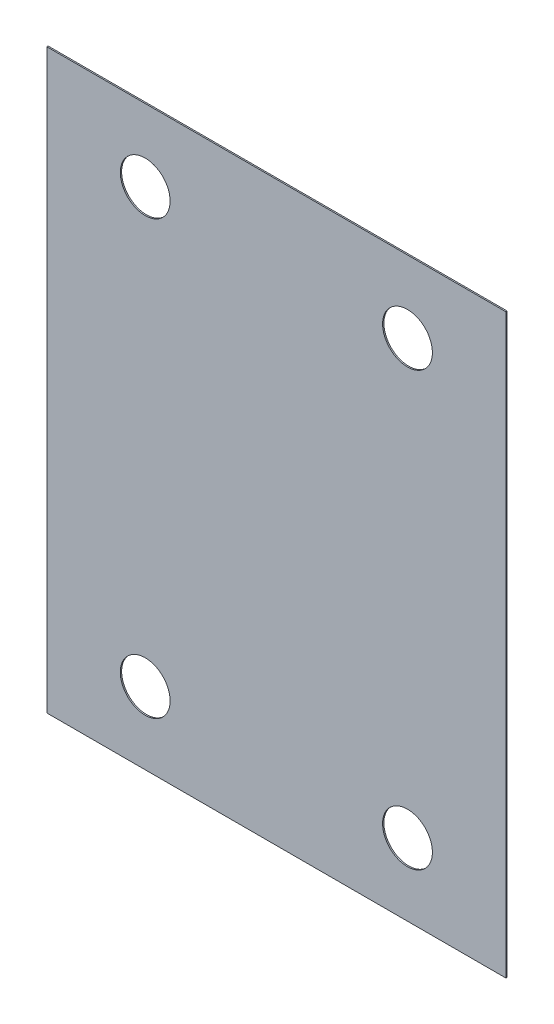
ISO-10303-21;
HEADER;
FILE_DESCRIPTION(('STEP AP214'),'2;1');
FILE_NAME('part.step','',(''),(''),'','','');
FILE_SCHEMA(('AUTOMOTIVE_DESIGN { 1 0 10303 214 1 1 1 1 }'));
ENDSEC;
DATA;
#1=APPLICATION_CONTEXT('core data for automotive mechanical design processes');
#2=APPLICATION_PROTOCOL_DEFINITION('international standard','automotive_design',2000,#1);
#3=PRODUCT_CONTEXT('',#1,'mechanical');
#4=PRODUCT('Part','Part','',(#3));
#5=PRODUCT_RELATED_PRODUCT_CATEGORY('part','',(#4));
#6=PRODUCT_DEFINITION_FORMATION('','',#4);
#7=PRODUCT_DEFINITION_CONTEXT('part definition',#1,'design');
#8=PRODUCT_DEFINITION('design','',#6,#7);
#9=PRODUCT_DEFINITION_SHAPE('','',#8);
#10=(LENGTH_UNIT() NAMED_UNIT(*) SI_UNIT(.MILLI.,.METRE.));
#11=(NAMED_UNIT(*) PLANE_ANGLE_UNIT() SI_UNIT($,.RADIAN.));
#12=(NAMED_UNIT(*) SI_UNIT($,.STERADIAN.) SOLID_ANGLE_UNIT());
#13=UNCERTAINTY_MEASURE_WITH_UNIT(LENGTH_MEASURE(1.E-05),#10,'distance_accuracy_value','');
#14=(GEOMETRIC_REPRESENTATION_CONTEXT(3) GLOBAL_UNCERTAINTY_ASSIGNED_CONTEXT((#13)) GLOBAL_UNIT_ASSIGNED_CONTEXT((#10,
#11,#12)) REPRESENTATION_CONTEXT('',''));
#15=CARTESIAN_POINT('',(0.,0.,0.));
#16=DIRECTION('',(0.,0.,1.));
#17=DIRECTION('',(1.,0.,0.));
#18=AXIS2_PLACEMENT_3D('',#15,#16,#17);
#19=CARTESIAN_POINT('',(0.,0.,1.));
#20=DIRECTION('',(0.,0.,1.));
#21=DIRECTION('',(1.,0.,0.));
#22=AXIS2_PLACEMENT_3D('',#19,#20,#21);
#23=PLANE('',#22);
#24=CARTESIAN_POINT('',(100.,-165.,1.));
#25=DIRECTION('',(0.,0.,1.));
#26=DIRECTION('',(1.,0.,0.));
#27=AXIS2_PLACEMENT_3D('',#24,#25,#26);
#28=CIRCLE('',#27,19.);
#29=CARTESIAN_POINT('',(119.,-165.,1.));
#30=VERTEX_POINT('',#29);
#31=EDGE_CURVE('E121',#30,#30,#28,.T.);
#32=ORIENTED_EDGE('',*,*,#31,.F.);
#33=EDGE_LOOP('',(#32));
#34=FACE_BOUND('',#33,.T.);
#35=CARTESIAN_POINT('',(-100.,165.,1.));
#36=DIRECTION('',(0.,0.,1.));
#37=DIRECTION('',(1.,0.,0.));
#38=AXIS2_PLACEMENT_3D('',#35,#36,#37);
#39=CIRCLE('',#38,19.0000000000034);
#40=CARTESIAN_POINT('',(-80.9999999999966,165.,1.));
#41=VERTEX_POINT('',#40);
#42=EDGE_CURVE('E100',#41,#41,#39,.T.);
#43=ORIENTED_EDGE('',*,*,#42,.F.);
#44=EDGE_LOOP('',(#43));
#45=FACE_BOUND('',#44,.T.);
#46=DIRECTION('',(1.,0.,0.));
#47=VECTOR('',#46,1.);
#48=CARTESIAN_POINT('',(-175.,-220.,1.));
#49=LINE('',#48,#47);
#50=CARTESIAN_POINT('',(-175.,-220.,1.));
#51=VERTEX_POINT('',#50);
#52=CARTESIAN_POINT('',(175.,-220.,1.));
#53=VERTEX_POINT('',#52);
#54=EDGE_CURVE('E85',#51,#53,#49,.T.);
#55=ORIENTED_EDGE('',*,*,#54,.T.);
#56=DIRECTION('',(0.,1.,0.));
#57=VECTOR('',#56,1.);
#58=CARTESIAN_POINT('',(175.,-220.,1.));
#59=LINE('',#58,#57);
#60=CARTESIAN_POINT('',(175.,220.,1.));
#61=VERTEX_POINT('',#60);
#62=EDGE_CURVE('E80',#53,#61,#59,.T.);
#63=ORIENTED_EDGE('',*,*,#62,.T.);
#64=DIRECTION('',(-1.,0.,0.));
#65=VECTOR('',#64,1.);
#66=CARTESIAN_POINT('',(175.,220.,1.));
#67=LINE('',#66,#65);
#68=CARTESIAN_POINT('',(-175.,220.,1.));
#69=VERTEX_POINT('',#68);
#70=EDGE_CURVE('E83',#61,#69,#67,.T.);
#71=ORIENTED_EDGE('',*,*,#70,.T.);
#72=DIRECTION('',(0.,-1.,0.));
#73=VECTOR('',#72,1.);
#74=CARTESIAN_POINT('',(-175.,220.,1.));
#75=LINE('',#74,#73);
#76=EDGE_CURVE('E50',#69,#51,#75,.T.);
#77=ORIENTED_EDGE('',*,*,#76,.T.);
#78=EDGE_LOOP('',(#55,#63,#71,#77));
#79=FACE_BOUND('',#78,.T.);
#80=CARTESIAN_POINT('',(100.,165.,1.));
#81=DIRECTION('',(0.,0.,1.));
#82=DIRECTION('',(1.,0.,0.));
#83=AXIS2_PLACEMENT_3D('',#80,#81,#82);
#84=CIRCLE('',#83,18.999999999996);
#85=CARTESIAN_POINT('',(118.999999999996,165.,1.));
#86=VERTEX_POINT('',#85);
#87=EDGE_CURVE('E115',#86,#86,#84,.T.);
#88=ORIENTED_EDGE('',*,*,#87,.F.);
#89=EDGE_LOOP('',(#88));
#90=FACE_BOUND('',#89,.T.);
#91=CARTESIAN_POINT('',(-100.,-165.,1.));
#92=DIRECTION('',(0.,0.,1.));
#93=DIRECTION('',(1.,0.,0.));
#94=AXIS2_PLACEMENT_3D('',#91,#92,#93);
#95=CIRCLE('',#94,19.);
#96=CARTESIAN_POINT('',(-81.,-165.,1.));
#97=VERTEX_POINT('',#96);
#98=EDGE_CURVE('E127',#97,#97,#95,.T.);
#99=ORIENTED_EDGE('',*,*,#98,.F.);
#100=EDGE_LOOP('',(#99));
#101=FACE_BOUND('',#100,.T.);
#102=ADVANCED_FACE('F33',(#34,#45,#79,#90,#101),#23,.T.);
#103=CARTESIAN_POINT('',(0.,0.,0.));
#104=DIRECTION('',(0.,0.,1.));
#105=DIRECTION('',(1.,0.,0.));
#106=AXIS2_PLACEMENT_3D('',#103,#104,#105);
#107=PLANE('',#106);
#108=DIRECTION('',(1.,0.,0.));
#109=VECTOR('',#108,1.);
#110=CARTESIAN_POINT('',(-175.,-220.,0.));
#111=LINE('',#110,#109);
#112=CARTESIAN_POINT('',(-175.,-220.,0.));
#113=VERTEX_POINT('',#112);
#114=CARTESIAN_POINT('',(175.,-220.,0.));
#115=VERTEX_POINT('',#114);
#116=EDGE_CURVE('E97',#113,#115,#111,.T.);
#117=ORIENTED_EDGE('',*,*,#116,.F.);
#118=DIRECTION('',(0.,-1.,0.));
#119=VECTOR('',#118,1.);
#120=CARTESIAN_POINT('',(-175.,220.,0.));
#121=LINE('',#120,#119);
#122=CARTESIAN_POINT('',(-175.,220.,0.));
#123=VERTEX_POINT('',#122);
#124=EDGE_CURVE('E73',#123,#113,#121,.T.);
#125=ORIENTED_EDGE('',*,*,#124,.F.);
#126=DIRECTION('',(-1.,0.,0.));
#127=VECTOR('',#126,1.);
#128=CARTESIAN_POINT('',(175.,220.,0.));
#129=LINE('',#128,#127);
#130=CARTESIAN_POINT('',(175.,220.,0.));
#131=VERTEX_POINT('',#130);
#132=EDGE_CURVE('E67',#131,#123,#129,.T.);
#133=ORIENTED_EDGE('',*,*,#132,.F.);
#134=DIRECTION('',(0.,1.,0.));
#135=VECTOR('',#134,1.);
#136=CARTESIAN_POINT('',(175.,-220.,0.));
#137=LINE('',#136,#135);
#138=EDGE_CURVE('E89',#115,#131,#137,.T.);
#139=ORIENTED_EDGE('',*,*,#138,.F.);
#140=EDGE_LOOP('',(#117,#125,#133,#139));
#141=FACE_BOUND('',#140,.T.);
#142=CARTESIAN_POINT('',(-100.,165.,0.));
#143=DIRECTION('',(0.,0.,1.));
#144=DIRECTION('',(1.,0.,0.));
#145=AXIS2_PLACEMENT_3D('',#142,#143,#144);
#146=CIRCLE('',#145,19.0000000000034);
#147=CARTESIAN_POINT('',(-80.9999999999966,165.,0.));
#148=VERTEX_POINT('',#147);
#149=EDGE_CURVE('E112',#148,#148,#146,.T.);
#150=ORIENTED_EDGE('',*,*,#149,.T.);
#151=EDGE_LOOP('',(#150));
#152=FACE_BOUND('',#151,.T.);
#153=CARTESIAN_POINT('',(100.,165.,0.));
#154=DIRECTION('',(0.,0.,1.));
#155=DIRECTION('',(1.,0.,0.));
#156=AXIS2_PLACEMENT_3D('',#153,#154,#155);
#157=CIRCLE('',#156,18.999999999996);
#158=CARTESIAN_POINT('',(118.999999999996,165.,0.));
#159=VERTEX_POINT('',#158);
#160=EDGE_CURVE('E118',#159,#159,#157,.T.);
#161=ORIENTED_EDGE('',*,*,#160,.T.);
#162=EDGE_LOOP('',(#161));
#163=FACE_BOUND('',#162,.T.);
#164=CARTESIAN_POINT('',(100.,-165.,0.));
#165=DIRECTION('',(0.,0.,1.));
#166=DIRECTION('',(1.,0.,0.));
#167=AXIS2_PLACEMENT_3D('',#164,#165,#166);
#168=CIRCLE('',#167,19.);
#169=CARTESIAN_POINT('',(119.,-165.,0.));
#170=VERTEX_POINT('',#169);
#171=EDGE_CURVE('E124',#170,#170,#168,.T.);
#172=ORIENTED_EDGE('',*,*,#171,.T.);
#173=EDGE_LOOP('',(#172));
#174=FACE_BOUND('',#173,.T.);
#175=CARTESIAN_POINT('',(-100.,-165.,0.));
#176=DIRECTION('',(0.,0.,1.));
#177=DIRECTION('',(1.,0.,0.));
#178=AXIS2_PLACEMENT_3D('',#175,#176,#177);
#179=CIRCLE('',#178,19.);
#180=CARTESIAN_POINT('',(-81.,-165.,0.));
#181=VERTEX_POINT('',#180);
#182=EDGE_CURVE('E130',#181,#181,#179,.T.);
#183=ORIENTED_EDGE('',*,*,#182,.T.);
#184=EDGE_LOOP('',(#183));
#185=FACE_BOUND('',#184,.T.);
#186=ADVANCED_FACE('F108',(#141,#152,#163,#174,#185),#107,.F.);
#187=CARTESIAN_POINT('',(-175.,-220.,1.));
#188=DIRECTION('',(0.,1.,0.));
#189=DIRECTION('',(0.,0.,1.));
#190=AXIS2_PLACEMENT_3D('',#187,#188,#189);
#191=PLANE('',#190);
#192=ORIENTED_EDGE('',*,*,#116,.T.);
#193=DIRECTION('',(0.,0.,-1.));
#194=VECTOR('',#193,1.);
#195=CARTESIAN_POINT('',(175.,-220.,1.));
#196=LINE('',#195,#194);
#197=EDGE_CURVE('E11',#53,#115,#196,.T.);
#198=ORIENTED_EDGE('',*,*,#197,.F.);
#199=ORIENTED_EDGE('',*,*,#54,.F.);
#200=DIRECTION('',(0.,0.,-1.));
#201=VECTOR('',#200,1.);
#202=CARTESIAN_POINT('',(-175.,-220.,1.));
#203=LINE('',#202,#201);
#204=EDGE_CURVE('E93',#51,#113,#203,.T.);
#205=ORIENTED_EDGE('',*,*,#204,.T.);
#206=EDGE_LOOP('',(#192,#198,#199,#205));
#207=FACE_BOUND('',#206,.T.);
#208=ADVANCED_FACE('F35',(#207),#191,.F.);
#209=CARTESIAN_POINT('',(175.,-220.,1.));
#210=DIRECTION('',(-1.,0.,0.));
#211=DIRECTION('',(0.,0.,1.));
#212=AXIS2_PLACEMENT_3D('',#209,#210,#211);
#213=PLANE('',#212);
#214=ORIENTED_EDGE('',*,*,#138,.T.);
#215=DIRECTION('',(0.,0.,-1.));
#216=VECTOR('',#215,1.);
#217=CARTESIAN_POINT('',(175.,220.,1.));
#218=LINE('',#217,#216);
#219=EDGE_CURVE('E42',#61,#131,#218,.T.);
#220=ORIENTED_EDGE('',*,*,#219,.F.);
#221=ORIENTED_EDGE('',*,*,#62,.F.);
#222=ORIENTED_EDGE('',*,*,#197,.T.);
#223=EDGE_LOOP('',(#214,#220,#221,#222));
#224=FACE_BOUND('',#223,.T.);
#225=ADVANCED_FACE('F88',(#224),#213,.F.);
#226=CARTESIAN_POINT('',(175.,220.,1.));
#227=DIRECTION('',(0.,-1.,0.));
#228=DIRECTION('',(0.,0.,-1.));
#229=AXIS2_PLACEMENT_3D('',#226,#227,#228);
#230=PLANE('',#229);
#231=ORIENTED_EDGE('',*,*,#132,.T.);
#232=DIRECTION('',(0.,0.,-1.));
#233=VECTOR('',#232,1.);
#234=CARTESIAN_POINT('',(-175.,220.,1.));
#235=LINE('',#234,#233);
#236=EDGE_CURVE('E90',#69,#123,#235,.T.);
#237=ORIENTED_EDGE('',*,*,#236,.F.);
#238=ORIENTED_EDGE('',*,*,#70,.F.);
#239=ORIENTED_EDGE('',*,*,#219,.T.);
#240=EDGE_LOOP('',(#231,#237,#238,#239));
#241=FACE_BOUND('',#240,.T.);
#242=ADVANCED_FACE('F91',(#241),#230,.F.);
#243=CARTESIAN_POINT('',(-175.,220.,1.));
#244=DIRECTION('',(1.,0.,0.));
#245=DIRECTION('',(0.,0.,-1.));
#246=AXIS2_PLACEMENT_3D('',#243,#244,#245);
#247=PLANE('',#246);
#248=ORIENTED_EDGE('',*,*,#124,.T.);
#249=ORIENTED_EDGE('',*,*,#204,.F.);
#250=ORIENTED_EDGE('',*,*,#76,.F.);
#251=ORIENTED_EDGE('',*,*,#236,.T.);
#252=EDGE_LOOP('',(#248,#249,#250,#251));
#253=FACE_BOUND('',#252,.T.);
#254=ADVANCED_FACE('F105',(#253),#247,.F.);
#255=CARTESIAN_POINT('',(-100.,165.,1.));
#256=DIRECTION('',(0.,0.,-1.));
#257=DIRECTION('',(-1.,0.,0.));
#258=AXIS2_PLACEMENT_3D('',#255,#256,#257);
#259=CYLINDRICAL_SURFACE('',#258,19.0000000000034);
#260=ORIENTED_EDGE('',*,*,#42,.T.);
#261=EDGE_LOOP('',(#260));
#262=FACE_BOUND('',#261,.T.);
#263=ORIENTED_EDGE('',*,*,#149,.F.);
#264=EDGE_LOOP('',(#263));
#265=FACE_BOUND('',#264,.T.);
#266=ADVANCED_FACE('F149',(#262,#265),#259,.F.);
#267=CARTESIAN_POINT('',(100.,165.,1.));
#268=DIRECTION('',(0.,0.,-1.));
#269=DIRECTION('',(-1.,0.,0.));
#270=AXIS2_PLACEMENT_3D('',#267,#268,#269);
#271=CYLINDRICAL_SURFACE('',#270,18.999999999996);
#272=ORIENTED_EDGE('',*,*,#87,.T.);
#273=EDGE_LOOP('',(#272));
#274=FACE_BOUND('',#273,.T.);
#275=ORIENTED_EDGE('',*,*,#160,.F.);
#276=EDGE_LOOP('',(#275));
#277=FACE_BOUND('',#276,.T.);
#278=ADVANCED_FACE('F195',(#274,#277),#271,.F.);
#279=CARTESIAN_POINT('',(100.,-165.,1.));
#280=DIRECTION('',(0.,0.,-1.));
#281=DIRECTION('',(-1.,0.,0.));
#282=AXIS2_PLACEMENT_3D('',#279,#280,#281);
#283=CYLINDRICAL_SURFACE('',#282,19.);
#284=ORIENTED_EDGE('',*,*,#31,.T.);
#285=EDGE_LOOP('',(#284));
#286=FACE_BOUND('',#285,.T.);
#287=ORIENTED_EDGE('',*,*,#171,.F.);
#288=EDGE_LOOP('',(#287));
#289=FACE_BOUND('',#288,.T.);
#290=ADVANCED_FACE('F203',(#286,#289),#283,.F.);
#291=CARTESIAN_POINT('',(-100.,-165.,1.));
#292=DIRECTION('',(0.,0.,-1.));
#293=DIRECTION('',(-1.,0.,0.));
#294=AXIS2_PLACEMENT_3D('',#291,#292,#293);
#295=CYLINDRICAL_SURFACE('',#294,19.);
#296=ORIENTED_EDGE('',*,*,#98,.T.);
#297=EDGE_LOOP('',(#296));
#298=FACE_BOUND('',#297,.T.);
#299=ORIENTED_EDGE('',*,*,#182,.F.);
#300=EDGE_LOOP('',(#299));
#301=FACE_BOUND('',#300,.T.);
#302=ADVANCED_FACE('F136',(#298,#301),#295,.F.);
#303=CLOSED_SHELL('',(#102,#186,#208,#225,#242,#254,#266,#278,#290,#302));
#304=MANIFOLD_SOLID_BREP('B2',#303);
#305=ADVANCED_BREP_SHAPE_REPRESENTATION('',(#18,#304),#14);
#306=SHAPE_DEFINITION_REPRESENTATION(#9,#305);
ENDSEC;
END-ISO-10303-21;
